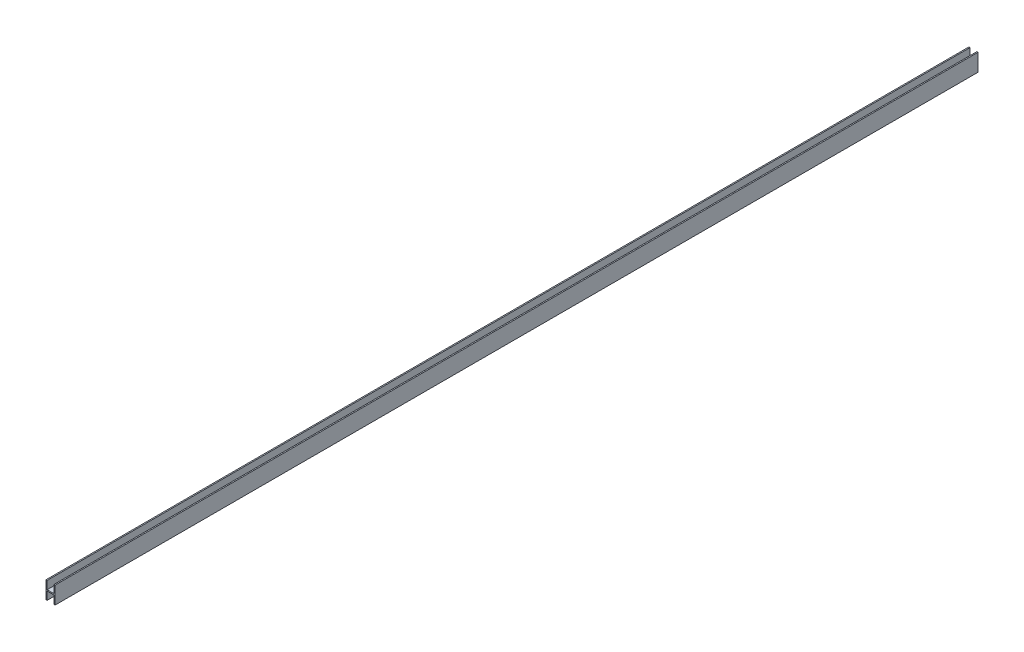
ISO-10303-21;
HEADER;
FILE_DESCRIPTION(('STEP AP214'),'2;1');
FILE_NAME('part.step','',(''),(''),'','','');
FILE_SCHEMA(('AUTOMOTIVE_DESIGN { 1 0 10303 214 1 1 1 1 }'));
ENDSEC;
DATA;
#1=APPLICATION_CONTEXT('core data for automotive mechanical design processes');
#2=APPLICATION_PROTOCOL_DEFINITION('international standard','automotive_design',2000,#1);
#3=PRODUCT_CONTEXT('',#1,'mechanical');
#4=PRODUCT('Part','Part','',(#3));
#5=PRODUCT_RELATED_PRODUCT_CATEGORY('part','',(#4));
#6=PRODUCT_DEFINITION_FORMATION('','',#4);
#7=PRODUCT_DEFINITION_CONTEXT('part definition',#1,'design');
#8=PRODUCT_DEFINITION('design','',#6,#7);
#9=PRODUCT_DEFINITION_SHAPE('','',#8);
#10=(LENGTH_UNIT() NAMED_UNIT(*) SI_UNIT(.MILLI.,.METRE.));
#11=(NAMED_UNIT(*) PLANE_ANGLE_UNIT() SI_UNIT($,.RADIAN.));
#12=(NAMED_UNIT(*) SI_UNIT($,.STERADIAN.) SOLID_ANGLE_UNIT());
#13=UNCERTAINTY_MEASURE_WITH_UNIT(LENGTH_MEASURE(1.E-05),#10,'distance_accuracy_value','');
#14=(GEOMETRIC_REPRESENTATION_CONTEXT(3) GLOBAL_UNCERTAINTY_ASSIGNED_CONTEXT((#13)) GLOBAL_UNIT_ASSIGNED_CONTEXT((#10,
#11,#12)) REPRESENTATION_CONTEXT('',''));
#15=CARTESIAN_POINT('',(0.,0.,0.));
#16=DIRECTION('',(0.,0.,1.));
#17=DIRECTION('',(1.,0.,0.));
#18=AXIS2_PLACEMENT_3D('',#15,#16,#17);
#19=CARTESIAN_POINT('',(-4.,7.5,800.));
#20=DIRECTION('',(0.,-1.,0.));
#21=DIRECTION('',(0.,0.,-1.));
#22=AXIS2_PLACEMENT_3D('',#19,#20,#21);
#23=PLANE('',#22);
#24=DIRECTION('',(-1.,0.,0.));
#25=VECTOR('',#24,1.);
#26=CARTESIAN_POINT('',(-4.,7.5,800.));
#27=LINE('',#26,#25);
#28=CARTESIAN_POINT('',(-3.,7.5,800.));
#29=VERTEX_POINT('',#28);
#30=CARTESIAN_POINT('',(-4.,7.5,800.));
#31=VERTEX_POINT('',#30);
#32=EDGE_CURVE('E184',#29,#31,#27,.T.);
#33=ORIENTED_EDGE('',*,*,#32,.F.);
#34=DIRECTION('',(0.,0.,-1.));
#35=VECTOR('',#34,1.);
#36=CARTESIAN_POINT('',(-3.,7.5,800.));
#37=LINE('',#36,#35);
#38=CARTESIAN_POINT('',(-3.,7.5,0.));
#39=VERTEX_POINT('',#38);
#40=EDGE_CURVE('E166',#29,#39,#37,.T.);
#41=ORIENTED_EDGE('',*,*,#40,.T.);
#42=DIRECTION('',(-1.,0.,0.));
#43=VECTOR('',#42,1.);
#44=CARTESIAN_POINT('',(-4.,7.5,0.));
#45=LINE('',#44,#43);
#46=CARTESIAN_POINT('',(-4.,7.5,0.));
#47=VERTEX_POINT('',#46);
#48=EDGE_CURVE('E198',#39,#47,#45,.T.);
#49=ORIENTED_EDGE('',*,*,#48,.T.);
#50=DIRECTION('',(0.,0.,-1.));
#51=VECTOR('',#50,1.);
#52=CARTESIAN_POINT('',(-4.,7.5,800.));
#53=LINE('',#52,#51);
#54=EDGE_CURVE('E211',#31,#47,#53,.T.);
#55=ORIENTED_EDGE('',*,*,#54,.F.);
#56=EDGE_LOOP('',(#33,#41,#49,#55));
#57=FACE_BOUND('',#56,.T.);
#58=ADVANCED_FACE('F36',(#57),#23,.F.);
#59=CARTESIAN_POINT('',(-4.,-7.5,800.));
#60=DIRECTION('',(0.,1.,0.));
#61=DIRECTION('',(0.,0.,1.));
#62=AXIS2_PLACEMENT_3D('',#59,#60,#61);
#63=PLANE('',#62);
#64=DIRECTION('',(1.,0.,0.));
#65=VECTOR('',#64,1.);
#66=CARTESIAN_POINT('',(-4.,-7.5,0.));
#67=LINE('',#66,#65);
#68=CARTESIAN_POINT('',(-4.,-7.5,0.));
#69=VERTEX_POINT('',#68);
#70=CARTESIAN_POINT('',(-3.,-7.5,0.));
#71=VERTEX_POINT('',#70);
#72=EDGE_CURVE('E185',#69,#71,#67,.T.);
#73=ORIENTED_EDGE('',*,*,#72,.T.);
#74=DIRECTION('',(0.,0.,1.));
#75=VECTOR('',#74,1.);
#76=CARTESIAN_POINT('',(-3.,-7.5,800.));
#77=LINE('',#76,#75);
#78=CARTESIAN_POINT('',(-3.,-7.5,800.));
#79=VERTEX_POINT('',#78);
#80=EDGE_CURVE('E177',#71,#79,#77,.T.);
#81=ORIENTED_EDGE('',*,*,#80,.T.);
#82=DIRECTION('',(1.,0.,0.));
#83=VECTOR('',#82,1.);
#84=CARTESIAN_POINT('',(-4.,-7.5,800.));
#85=LINE('',#84,#83);
#86=CARTESIAN_POINT('',(-4.,-7.5,800.));
#87=VERTEX_POINT('',#86);
#88=EDGE_CURVE('E192',#87,#79,#85,.T.);
#89=ORIENTED_EDGE('',*,*,#88,.F.);
#90=DIRECTION('',(0.,0.,-1.));
#91=VECTOR('',#90,1.);
#92=CARTESIAN_POINT('',(-4.,-7.5,800.));
#93=LINE('',#92,#91);
#94=EDGE_CURVE('E208',#87,#69,#93,.T.);
#95=ORIENTED_EDGE('',*,*,#94,.T.);
#96=EDGE_LOOP('',(#73,#81,#89,#95));
#97=FACE_BOUND('',#96,.T.);
#98=ADVANCED_FACE('F241',(#97),#63,.F.);
#99=CARTESIAN_POINT('',(4.,-7.5,800.));
#100=DIRECTION('',(-1.,0.,0.));
#101=DIRECTION('',(0.,0.,1.));
#102=AXIS2_PLACEMENT_3D('',#99,#100,#101);
#103=PLANE('',#102);
#104=DIRECTION('',(0.,1.,0.));
#105=VECTOR('',#104,1.);
#106=CARTESIAN_POINT('',(4.,-7.5,0.));
#107=LINE('',#106,#105);
#108=CARTESIAN_POINT('',(4.,-7.5,0.));
#109=VERTEX_POINT('',#108);
#110=CARTESIAN_POINT('',(4.,7.5,0.));
#111=VERTEX_POINT('',#110);
#112=EDGE_CURVE('E180',#109,#111,#107,.T.);
#113=ORIENTED_EDGE('',*,*,#112,.T.);
#114=DIRECTION('',(0.,0.,-1.));
#115=VECTOR('',#114,1.);
#116=CARTESIAN_POINT('',(4.,7.5,800.));
#117=LINE('',#116,#115);
#118=CARTESIAN_POINT('',(4.,7.5,800.));
#119=VERTEX_POINT('',#118);
#120=EDGE_CURVE('E214',#119,#111,#117,.T.);
#121=ORIENTED_EDGE('',*,*,#120,.F.);
#122=DIRECTION('',(0.,1.,0.));
#123=VECTOR('',#122,1.);
#124=CARTESIAN_POINT('',(4.,-7.5,800.));
#125=LINE('',#124,#123);
#126=CARTESIAN_POINT('',(4.,-7.5,800.));
#127=VERTEX_POINT('',#126);
#128=EDGE_CURVE('E181',#127,#119,#125,.T.);
#129=ORIENTED_EDGE('',*,*,#128,.F.);
#130=DIRECTION('',(0.,0.,-1.));
#131=VECTOR('',#130,1.);
#132=CARTESIAN_POINT('',(4.,-7.5,800.));
#133=LINE('',#132,#131);
#134=EDGE_CURVE('E195',#127,#109,#133,.T.);
#135=ORIENTED_EDGE('',*,*,#134,.T.);
#136=EDGE_LOOP('',(#113,#121,#129,#135));
#137=FACE_BOUND('',#136,.T.);
#138=ADVANCED_FACE('F38',(#137),#103,.F.);
#139=CARTESIAN_POINT('',(3.,7.5,0.));
#140=VERTEX_POINT('',#139);
#141=EDGE_CURVE('E199',#111,#140,#45,.T.);
#142=ORIENTED_EDGE('',*,*,#141,.T.);
#143=DIRECTION('',(0.,0.,1.));
#144=VECTOR('',#143,1.);
#145=CARTESIAN_POINT('',(3.,7.5,800.));
#146=LINE('',#145,#144);
#147=CARTESIAN_POINT('',(3.,7.5,800.));
#148=VERTEX_POINT('',#147);
#149=EDGE_CURVE('E58',#140,#148,#146,.T.);
#150=ORIENTED_EDGE('',*,*,#149,.T.);
#151=EDGE_CURVE('E186',#119,#148,#27,.T.);
#152=ORIENTED_EDGE('',*,*,#151,.F.);
#153=ORIENTED_EDGE('',*,*,#120,.T.);
#154=EDGE_LOOP('',(#142,#150,#152,#153));
#155=FACE_BOUND('',#154,.T.);
#156=ADVANCED_FACE('F228',(#155),#23,.F.);
#157=CARTESIAN_POINT('',(-4.,-7.5,800.));
#158=DIRECTION('',(1.,0.,0.));
#159=DIRECTION('',(0.,0.,-1.));
#160=AXIS2_PLACEMENT_3D('',#157,#158,#159);
#161=PLANE('',#160);
#162=DIRECTION('',(0.,-1.,0.));
#163=VECTOR('',#162,1.);
#164=CARTESIAN_POINT('',(-4.,-7.5,0.));
#165=LINE('',#164,#163);
#166=EDGE_CURVE('E202',#47,#69,#165,.T.);
#167=ORIENTED_EDGE('',*,*,#166,.T.);
#168=ORIENTED_EDGE('',*,*,#94,.F.);
#169=DIRECTION('',(0.,-1.,0.));
#170=VECTOR('',#169,1.);
#171=CARTESIAN_POINT('',(-4.,-7.5,800.));
#172=LINE('',#171,#170);
#173=EDGE_CURVE('E189',#31,#87,#172,.T.);
#174=ORIENTED_EDGE('',*,*,#173,.F.);
#175=ORIENTED_EDGE('',*,*,#54,.T.);
#176=EDGE_LOOP('',(#167,#168,#174,#175));
#177=FACE_BOUND('',#176,.T.);
#178=ADVANCED_FACE('F246',(#177),#161,.F.);
#179=CARTESIAN_POINT('',(3.,-7.5,800.));
#180=VERTEX_POINT('',#179);
#181=EDGE_CURVE('E191',#180,#127,#85,.T.);
#182=ORIENTED_EDGE('',*,*,#181,.F.);
#183=DIRECTION('',(0.,0.,-1.));
#184=VECTOR('',#183,1.);
#185=CARTESIAN_POINT('',(3.,-7.5,800.));
#186=LINE('',#185,#184);
#187=CARTESIAN_POINT('',(3.,-7.5,0.));
#188=VERTEX_POINT('',#187);
#189=EDGE_CURVE('E172',#180,#188,#186,.T.);
#190=ORIENTED_EDGE('',*,*,#189,.T.);
#191=EDGE_CURVE('E145',#188,#109,#67,.T.);
#192=ORIENTED_EDGE('',*,*,#191,.T.);
#193=ORIENTED_EDGE('',*,*,#134,.F.);
#194=EDGE_LOOP('',(#182,#190,#192,#193));
#195=FACE_BOUND('',#194,.T.);
#196=ADVANCED_FACE('F235',(#195),#63,.F.);
#197=CARTESIAN_POINT('',(0.,0.,800.));
#198=DIRECTION('',(0.,0.,-1.));
#199=DIRECTION('',(-1.,0.,0.));
#200=AXIS2_PLACEMENT_3D('',#197,#198,#199);
#201=PLANE('',#200);
#202=ORIENTED_EDGE('',*,*,#88,.T.);
#203=DIRECTION('',(0.,1.,0.));
#204=VECTOR('',#203,1.);
#205=CARTESIAN_POINT('',(-3.,0.,800.));
#206=LINE('',#205,#204);
#207=CARTESIAN_POINT('',(-3.,-0.5,800.));
#208=VERTEX_POINT('',#207);
#209=EDGE_CURVE('E174',#79,#208,#206,.T.);
#210=ORIENTED_EDGE('',*,*,#209,.T.);
#211=DIRECTION('',(1.,0.,0.));
#212=VECTOR('',#211,1.);
#213=CARTESIAN_POINT('',(0.,-0.5,800.));
#214=LINE('',#213,#212);
#215=CARTESIAN_POINT('',(3.,-0.5,800.));
#216=VERTEX_POINT('',#215);
#217=EDGE_CURVE('E169',#208,#216,#214,.T.);
#218=ORIENTED_EDGE('',*,*,#217,.T.);
#219=DIRECTION('',(0.,-1.,0.));
#220=VECTOR('',#219,1.);
#221=CARTESIAN_POINT('',(3.,0.,800.));
#222=LINE('',#221,#220);
#223=EDGE_CURVE('E131',#216,#180,#222,.T.);
#224=ORIENTED_EDGE('',*,*,#223,.T.);
#225=ORIENTED_EDGE('',*,*,#181,.T.);
#226=ORIENTED_EDGE('',*,*,#128,.T.);
#227=ORIENTED_EDGE('',*,*,#151,.T.);
#228=DIRECTION('',(0.,-1.,0.));
#229=VECTOR('',#228,1.);
#230=CARTESIAN_POINT('',(3.,0.,800.));
#231=LINE('',#230,#229);
#232=CARTESIAN_POINT('',(3.,0.5,800.));
#233=VERTEX_POINT('',#232);
#234=EDGE_CURVE('E133',#148,#233,#231,.T.);
#235=ORIENTED_EDGE('',*,*,#234,.T.);
#236=DIRECTION('',(-1.,0.,0.));
#237=VECTOR('',#236,1.);
#238=CARTESIAN_POINT('',(0.,0.5,800.));
#239=LINE('',#238,#237);
#240=CARTESIAN_POINT('',(-3.,0.5,800.));
#241=VERTEX_POINT('',#240);
#242=EDGE_CURVE('E160',#233,#241,#239,.T.);
#243=ORIENTED_EDGE('',*,*,#242,.T.);
#244=DIRECTION('',(0.,1.,0.));
#245=VECTOR('',#244,1.);
#246=CARTESIAN_POINT('',(-3.,0.,800.));
#247=LINE('',#246,#245);
#248=EDGE_CURVE('E163',#241,#29,#247,.T.);
#249=ORIENTED_EDGE('',*,*,#248,.T.);
#250=ORIENTED_EDGE('',*,*,#32,.T.);
#251=ORIENTED_EDGE('',*,*,#173,.T.);
#252=EDGE_LOOP('',(#202,#210,#218,#224,#225,#226,#227,#235,#243,#249,#250,#251));
#253=FACE_BOUND('',#252,.T.);
#254=ADVANCED_FACE('F225',(#253),#201,.F.);
#255=CARTESIAN_POINT('',(0.,0.,0.));
#256=DIRECTION('',(0.,0.,-1.));
#257=DIRECTION('',(-1.,0.,0.));
#258=AXIS2_PLACEMENT_3D('',#255,#256,#257);
#259=PLANE('',#258);
#260=DIRECTION('',(0.,1.,0.));
#261=VECTOR('',#260,1.);
#262=CARTESIAN_POINT('',(-3.,0.,0.));
#263=LINE('',#262,#261);
#264=CARTESIAN_POINT('',(-3.,-0.5,0.));
#265=VERTEX_POINT('',#264);
#266=EDGE_CURVE('E11',#71,#265,#263,.T.);
#267=ORIENTED_EDGE('',*,*,#266,.F.);
#268=ORIENTED_EDGE('',*,*,#72,.F.);
#269=ORIENTED_EDGE('',*,*,#166,.F.);
#270=ORIENTED_EDGE('',*,*,#48,.F.);
#271=DIRECTION('',(0.,1.,0.));
#272=VECTOR('',#271,1.);
#273=CARTESIAN_POINT('',(-3.,0.5,0.));
#274=LINE('',#273,#272);
#275=CARTESIAN_POINT('',(-3.,0.5,0.));
#276=VERTEX_POINT('',#275);
#277=EDGE_CURVE('E149',#276,#39,#274,.T.);
#278=ORIENTED_EDGE('',*,*,#277,.F.);
#279=DIRECTION('',(-1.,0.,0.));
#280=VECTOR('',#279,1.);
#281=CARTESIAN_POINT('',(3.,0.5,0.));
#282=LINE('',#281,#280);
#283=CARTESIAN_POINT('',(3.,0.5,0.));
#284=VERTEX_POINT('',#283);
#285=EDGE_CURVE('E151',#284,#276,#282,.T.);
#286=ORIENTED_EDGE('',*,*,#285,.F.);
#287=DIRECTION('',(0.,-1.,0.));
#288=VECTOR('',#287,1.);
#289=CARTESIAN_POINT('',(3.,0.,0.));
#290=LINE('',#289,#288);
#291=EDGE_CURVE('E44',#140,#284,#290,.T.);
#292=ORIENTED_EDGE('',*,*,#291,.F.);
#293=ORIENTED_EDGE('',*,*,#141,.F.);
#294=ORIENTED_EDGE('',*,*,#112,.F.);
#295=ORIENTED_EDGE('',*,*,#191,.F.);
#296=DIRECTION('',(0.,-1.,0.));
#297=VECTOR('',#296,1.);
#298=CARTESIAN_POINT('',(3.,-14.5,0.));
#299=LINE('',#298,#297);
#300=CARTESIAN_POINT('',(3.,-0.5,0.));
#301=VERTEX_POINT('',#300);
#302=EDGE_CURVE('E128',#301,#188,#299,.T.);
#303=ORIENTED_EDGE('',*,*,#302,.F.);
#304=DIRECTION('',(1.,0.,0.));
#305=VECTOR('',#304,1.);
#306=CARTESIAN_POINT('',(3.,-0.5,0.));
#307=LINE('',#306,#305);
#308=EDGE_CURVE('E136',#265,#301,#307,.T.);
#309=ORIENTED_EDGE('',*,*,#308,.F.);
#310=EDGE_LOOP('',(#267,#268,#269,#270,#278,#286,#292,#293,#294,#295,#303,#309));
#311=FACE_BOUND('',#310,.T.);
#312=ADVANCED_FACE('F143',(#311),#259,.T.);
#313=CARTESIAN_POINT('',(-3.,0.5,2400.));
#314=DIRECTION('',(-1.,0.,0.));
#315=DIRECTION('',(0.,0.,1.));
#316=AXIS2_PLACEMENT_3D('',#313,#314,#315);
#317=PLANE('',#316);
#318=ORIENTED_EDGE('',*,*,#248,.F.);
#319=DIRECTION('',(0.,0.,-1.));
#320=VECTOR('',#319,1.);
#321=CARTESIAN_POINT('',(-3.,0.5,2400.));
#322=LINE('',#321,#320);
#323=EDGE_CURVE('E140',#241,#276,#322,.T.);
#324=ORIENTED_EDGE('',*,*,#323,.T.);
#325=ORIENTED_EDGE('',*,*,#277,.T.);
#326=ORIENTED_EDGE('',*,*,#40,.F.);
#327=EDGE_LOOP('',(#318,#324,#325,#326));
#328=FACE_BOUND('',#327,.T.);
#329=ADVANCED_FACE('F250',(#328),#317,.F.);
#330=CARTESIAN_POINT('',(3.,0.5,2400.));
#331=DIRECTION('',(0.,-1.,0.));
#332=DIRECTION('',(0.,0.,-1.));
#333=AXIS2_PLACEMENT_3D('',#330,#331,#332);
#334=PLANE('',#333);
#335=DIRECTION('',(0.,0.,-1.));
#336=VECTOR('',#335,1.);
#337=CARTESIAN_POINT('',(3.,0.5,2400.));
#338=LINE('',#337,#336);
#339=EDGE_CURVE('E154',#233,#284,#338,.T.);
#340=ORIENTED_EDGE('',*,*,#339,.T.);
#341=ORIENTED_EDGE('',*,*,#285,.T.);
#342=ORIENTED_EDGE('',*,*,#323,.F.);
#343=ORIENTED_EDGE('',*,*,#242,.F.);
#344=EDGE_LOOP('',(#340,#341,#342,#343));
#345=FACE_BOUND('',#344,.T.);
#346=ADVANCED_FACE('F223',(#345),#334,.F.);
#347=CARTESIAN_POINT('',(3.,0.5,2400.));
#348=DIRECTION('',(1.,0.,0.));
#349=DIRECTION('',(0.,0.,-1.));
#350=AXIS2_PLACEMENT_3D('',#347,#348,#349);
#351=PLANE('',#350);
#352=ORIENTED_EDGE('',*,*,#291,.T.);
#353=ORIENTED_EDGE('',*,*,#339,.F.);
#354=ORIENTED_EDGE('',*,*,#234,.F.);
#355=ORIENTED_EDGE('',*,*,#149,.F.);
#356=EDGE_LOOP('',(#352,#353,#354,#355));
#357=FACE_BOUND('',#356,.T.);
#358=ADVANCED_FACE('F218',(#357),#351,.F.);
#359=CARTESIAN_POINT('',(-3.,-14.5,2400.));
#360=DIRECTION('',(-1.,0.,0.));
#361=DIRECTION('',(0.,0.,1.));
#362=AXIS2_PLACEMENT_3D('',#359,#360,#361);
#363=PLANE('',#362);
#364=ORIENTED_EDGE('',*,*,#266,.T.);
#365=DIRECTION('',(0.,0.,-1.));
#366=VECTOR('',#365,1.);
#367=CARTESIAN_POINT('',(-3.,-0.5,2400.));
#368=LINE('',#367,#366);
#369=EDGE_CURVE('E51',#208,#265,#368,.T.);
#370=ORIENTED_EDGE('',*,*,#369,.F.);
#371=ORIENTED_EDGE('',*,*,#209,.F.);
#372=ORIENTED_EDGE('',*,*,#80,.F.);
#373=EDGE_LOOP('',(#364,#370,#371,#372));
#374=FACE_BOUND('',#373,.T.);
#375=ADVANCED_FACE('F237',(#374),#363,.F.);
#376=CARTESIAN_POINT('',(3.,-14.5,2400.));
#377=DIRECTION('',(1.,0.,0.));
#378=DIRECTION('',(0.,0.,-1.));
#379=AXIS2_PLACEMENT_3D('',#376,#377,#378);
#380=PLANE('',#379);
#381=ORIENTED_EDGE('',*,*,#223,.F.);
#382=DIRECTION('',(0.,0.,-1.));
#383=VECTOR('',#382,1.);
#384=CARTESIAN_POINT('',(3.,-0.5,2400.));
#385=LINE('',#384,#383);
#386=EDGE_CURVE('E125',#216,#301,#385,.T.);
#387=ORIENTED_EDGE('',*,*,#386,.T.);
#388=ORIENTED_EDGE('',*,*,#302,.T.);
#389=ORIENTED_EDGE('',*,*,#189,.F.);
#390=EDGE_LOOP('',(#381,#387,#388,#389));
#391=FACE_BOUND('',#390,.T.);
#392=ADVANCED_FACE('F126',(#391),#380,.F.);
#393=CARTESIAN_POINT('',(3.,-0.5,2400.));
#394=DIRECTION('',(0.,1.,0.));
#395=DIRECTION('',(0.,0.,1.));
#396=AXIS2_PLACEMENT_3D('',#393,#394,#395);
#397=PLANE('',#396);
#398=ORIENTED_EDGE('',*,*,#369,.T.);
#399=ORIENTED_EDGE('',*,*,#308,.T.);
#400=ORIENTED_EDGE('',*,*,#386,.F.);
#401=ORIENTED_EDGE('',*,*,#217,.F.);
#402=EDGE_LOOP('',(#398,#399,#400,#401));
#403=FACE_BOUND('',#402,.T.);
#404=ADVANCED_FACE('F137',(#403),#397,.F.);
#405=CLOSED_SHELL('',(#58,#98,#138,#156,#178,#196,#254,#312,#329,#346,#358,#375,#392,#404));
#406=MANIFOLD_SOLID_BREP('B2',#405);
#407=ADVANCED_BREP_SHAPE_REPRESENTATION('',(#18,#406),#14);
#408=SHAPE_DEFINITION_REPRESENTATION(#9,#407);
ENDSEC;
END-ISO-10303-21;
